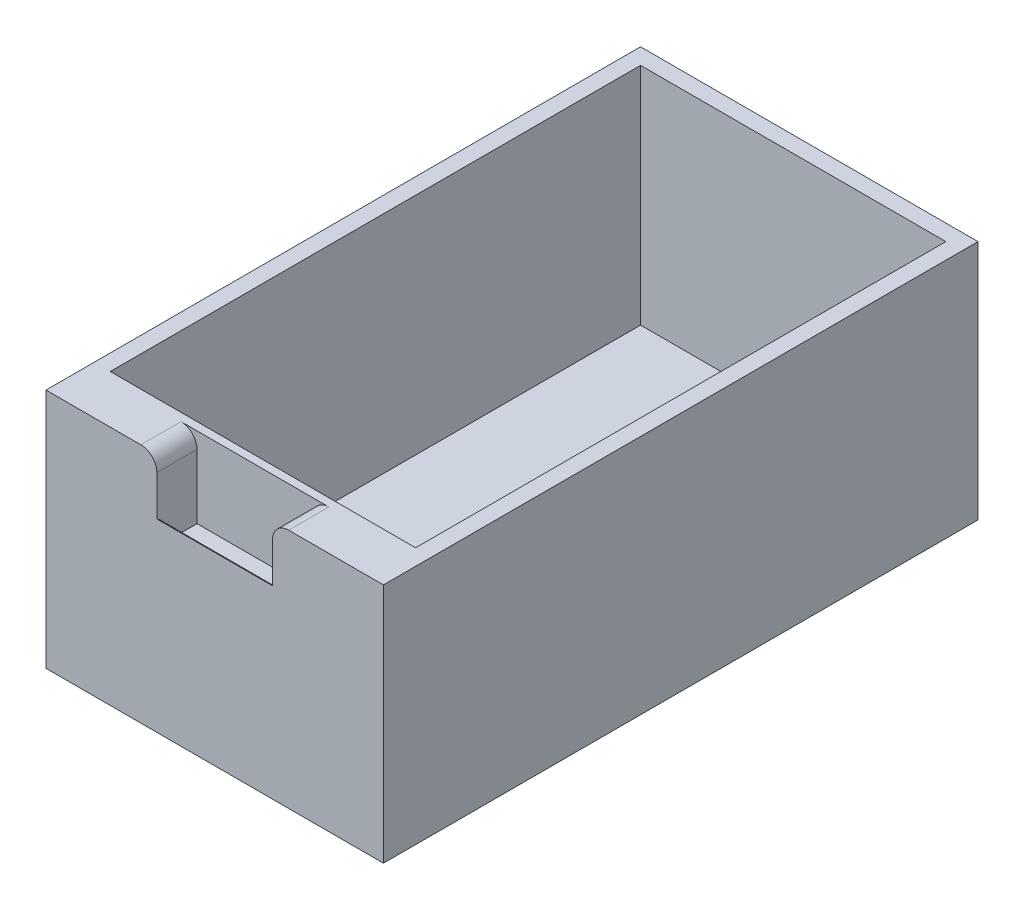
ISO-10303-21;
HEADER;
FILE_DESCRIPTION(('STEP AP214'),'2;1');
FILE_NAME('part.step','',(''),(''),'','','');
FILE_SCHEMA(('AUTOMOTIVE_DESIGN { 1 0 10303 214 1 1 1 1 }'));
ENDSEC;
DATA;
#1=APPLICATION_CONTEXT('core data for automotive mechanical design processes');
#2=APPLICATION_PROTOCOL_DEFINITION('international standard','automotive_design',2000,#1);
#3=PRODUCT_CONTEXT('',#1,'mechanical');
#4=PRODUCT('Part','Part','',(#3));
#5=PRODUCT_RELATED_PRODUCT_CATEGORY('part','',(#4));
#6=PRODUCT_DEFINITION_FORMATION('','',#4);
#7=PRODUCT_DEFINITION_CONTEXT('part definition',#1,'design');
#8=PRODUCT_DEFINITION('design','',#6,#7);
#9=PRODUCT_DEFINITION_SHAPE('','',#8);
#10=(LENGTH_UNIT() NAMED_UNIT(*) SI_UNIT(.MILLI.,.METRE.));
#11=(NAMED_UNIT(*) PLANE_ANGLE_UNIT() SI_UNIT($,.RADIAN.));
#12=(NAMED_UNIT(*) SI_UNIT($,.STERADIAN.) SOLID_ANGLE_UNIT());
#13=UNCERTAINTY_MEASURE_WITH_UNIT(LENGTH_MEASURE(1.E-05),#10,'distance_accuracy_value','');
#14=(GEOMETRIC_REPRESENTATION_CONTEXT(3) GLOBAL_UNCERTAINTY_ASSIGNED_CONTEXT((#13)) GLOBAL_UNIT_ASSIGNED_CONTEXT((#10,
#11,#12)) REPRESENTATION_CONTEXT('',''));
#15=CARTESIAN_POINT('',(0.,0.,0.));
#16=DIRECTION('',(0.,0.,1.));
#17=DIRECTION('',(1.,0.,0.));
#18=AXIS2_PLACEMENT_3D('',#15,#16,#17);
#19=CARTESIAN_POINT('',(-159.477344992051,63.8235294117647,-370.));
#20=DIRECTION('',(-1.,0.,0.));
#21=DIRECTION('',(0.,0.,1.));
#22=AXIS2_PLACEMENT_3D('',#19,#20,#21);
#23=PLANE('',#22);
#24=DIRECTION('',(0.,-1.,0.));
#25=VECTOR('',#24,1.);
#26=CARTESIAN_POINT('',(-159.477344992051,63.8235294117647,0.));
#27=LINE('',#26,#25);
#28=CARTESIAN_POINT('',(-159.477344992051,63.8235294117647,0.));
#29=VERTEX_POINT('',#28);
#30=CARTESIAN_POINT('',(-159.477344992051,-86.1764705882353,0.));
#31=VERTEX_POINT('',#30);
#32=EDGE_CURVE('E212',#29,#31,#27,.T.);
#33=ORIENTED_EDGE('',*,*,#32,.F.);
#34=DIRECTION('',(0.,0.,1.));
#35=VECTOR('',#34,1.);
#36=CARTESIAN_POINT('',(-159.477344992051,63.8235294117647,-370.));
#37=LINE('',#36,#35);
#38=CARTESIAN_POINT('',(-159.477344992051,63.8235294117647,-370.));
#39=VERTEX_POINT('',#38);
#40=EDGE_CURVE('E244',#39,#29,#37,.T.);
#41=ORIENTED_EDGE('',*,*,#40,.F.);
#42=DIRECTION('',(0.,-1.,0.));
#43=VECTOR('',#42,1.);
#44=CARTESIAN_POINT('',(-159.477344992051,63.8235294117647,-370.));
#45=LINE('',#44,#43);
#46=CARTESIAN_POINT('',(-159.477344992051,-86.1764705882353,-370.));
#47=VERTEX_POINT('',#46);
#48=EDGE_CURVE('E219',#39,#47,#45,.T.);
#49=ORIENTED_EDGE('',*,*,#48,.T.);
#50=DIRECTION('',(0.,0.,1.));
#51=VECTOR('',#50,1.);
#52=CARTESIAN_POINT('',(-159.477344992051,-86.1764705882353,-370.));
#53=LINE('',#52,#51);
#54=EDGE_CURVE('E232',#47,#31,#53,.T.);
#55=ORIENTED_EDGE('',*,*,#54,.T.);
#56=EDGE_LOOP('',(#33,#41,#49,#55));
#57=FACE_BOUND('',#56,.T.);
#58=ADVANCED_FACE('F35',(#57),#23,.T.);
#59=CARTESIAN_POINT('',(-159.477344992051,63.8235294117647,-370.));
#60=DIRECTION('',(0.,1.,0.));
#61=DIRECTION('',(0.,0.,1.));
#62=AXIS2_PLACEMENT_3D('',#59,#60,#61);
#63=PLANE('',#62);
#64=DIRECTION('',(-1.,0.,0.));
#65=VECTOR('',#64,1.);
#66=CARTESIAN_POINT('',(-90.4773449920508,63.8235294117647,-25.));
#67=LINE('',#66,#65);
#68=CARTESIAN_POINT('',(-8.47734499205077,63.8235294117647,-25.));
#69=VERTEX_POINT('',#68);
#70=CARTESIAN_POINT('',(-100.477344992051,63.8235294117647,-25.));
#71=VERTEX_POINT('',#70);
#72=EDGE_CURVE('E170',#69,#71,#67,.T.);
#73=ORIENTED_EDGE('',*,*,#72,.F.);
#74=DIRECTION('',(0.,0.,-1.));
#75=VECTOR('',#74,1.);
#76=CARTESIAN_POINT('',(-8.47734499205077,63.8235294117647,0.));
#77=LINE('',#76,#75);
#78=CARTESIAN_POINT('',(-8.47734499205077,63.8235294117647,0.));
#79=VERTEX_POINT('',#78);
#80=EDGE_CURVE('E265',#69,#79,#77,.F.);
#81=ORIENTED_EDGE('',*,*,#80,.T.);
#82=DIRECTION('',(-1.,0.,0.));
#83=VECTOR('',#82,1.);
#84=CARTESIAN_POINT('',(-159.477344992051,63.8235294117647,0.));
#85=LINE('',#84,#83);
#86=CARTESIAN_POINT('',(50.5226550079492,63.8235294117647,0.));
#87=VERTEX_POINT('',#86);
#88=EDGE_CURVE('E223',#87,#79,#85,.T.);
#89=ORIENTED_EDGE('',*,*,#88,.F.);
#90=DIRECTION('',(0.,0.,1.));
#91=VECTOR('',#90,1.);
#92=CARTESIAN_POINT('',(50.5226550079492,63.8235294117647,-370.));
#93=LINE('',#92,#91);
#94=CARTESIAN_POINT('',(50.5226550079492,63.8235294117647,-370.));
#95=VERTEX_POINT('',#94);
#96=EDGE_CURVE('E248',#95,#87,#93,.T.);
#97=ORIENTED_EDGE('',*,*,#96,.F.);
#98=DIRECTION('',(-1.,0.,0.));
#99=VECTOR('',#98,1.);
#100=CARTESIAN_POINT('',(-159.477344992051,63.8235294117647,-370.));
#101=LINE('',#100,#99);
#102=EDGE_CURVE('E229',#95,#39,#101,.T.);
#103=ORIENTED_EDGE('',*,*,#102,.T.);
#104=ORIENTED_EDGE('',*,*,#40,.T.);
#105=CARTESIAN_POINT('',(-100.477344992051,63.8235294117647,0.));
#106=VERTEX_POINT('',#105);
#107=EDGE_CURVE('E241',#106,#29,#85,.T.);
#108=ORIENTED_EDGE('',*,*,#107,.F.);
#109=DIRECTION('',(0.,0.,1.));
#110=VECTOR('',#109,1.);
#111=CARTESIAN_POINT('',(-100.477344992051,63.8235294117647,-25.));
#112=LINE('',#111,#110);
#113=EDGE_CURVE('E257',#106,#71,#112,.F.);
#114=ORIENTED_EDGE('',*,*,#113,.T.);
#115=EDGE_LOOP('',(#73,#81,#89,#97,#103,#104,#108,#114));
#116=FACE_BOUND('',#115,.T.);
#117=DIRECTION('',(0.,0.,1.));
#118=VECTOR('',#117,1.);
#119=CARTESIAN_POINT('',(-149.477344992051,63.8235294117647,-360.));
#120=LINE('',#119,#118);
#121=CARTESIAN_POINT('',(-149.477344992051,63.8235294117647,-360.));
#122=VERTEX_POINT('',#121);
#123=CARTESIAN_POINT('',(-149.477344992051,63.8235294117647,-30.));
#124=VERTEX_POINT('',#123);
#125=EDGE_CURVE('E178',#122,#124,#120,.T.);
#126=ORIENTED_EDGE('',*,*,#125,.F.);
#127=DIRECTION('',(-1.,0.,0.));
#128=VECTOR('',#127,1.);
#129=CARTESIAN_POINT('',(-149.477344992051,63.8235294117647,-360.));
#130=LINE('',#129,#128);
#131=CARTESIAN_POINT('',(40.5226550079492,63.8235294117647,-360.));
#132=VERTEX_POINT('',#131);
#133=EDGE_CURVE('E191',#132,#122,#130,.T.);
#134=ORIENTED_EDGE('',*,*,#133,.F.);
#135=DIRECTION('',(0.,0.,-1.));
#136=VECTOR('',#135,1.);
#137=CARTESIAN_POINT('',(40.5226550079492,63.8235294117647,-360.));
#138=LINE('',#137,#136);
#139=CARTESIAN_POINT('',(40.5226550079492,63.8235294117647,-30.));
#140=VERTEX_POINT('',#139);
#141=EDGE_CURVE('E205',#140,#132,#138,.T.);
#142=ORIENTED_EDGE('',*,*,#141,.F.);
#143=DIRECTION('',(1.,0.,0.));
#144=VECTOR('',#143,1.);
#145=CARTESIAN_POINT('',(-149.477344992051,63.8235294117647,-30.));
#146=LINE('',#145,#144);
#147=EDGE_CURVE('E202',#124,#140,#146,.T.);
#148=ORIENTED_EDGE('',*,*,#147,.F.);
#149=EDGE_LOOP('',(#126,#134,#142,#148));
#150=FACE_BOUND('',#149,.T.);
#151=ADVANCED_FACE('F289',(#116,#150),#63,.T.);
#152=CARTESIAN_POINT('',(50.5226550079492,63.8235294117647,-370.));
#153=DIRECTION('',(1.,0.,0.));
#154=DIRECTION('',(0.,1.,0.));
#155=AXIS2_PLACEMENT_3D('',#152,#153,#154);
#156=PLANE('',#155);
#157=DIRECTION('',(0.,1.,0.));
#158=VECTOR('',#157,1.);
#159=CARTESIAN_POINT('',(50.5226550079492,63.8235294117647,0.));
#160=LINE('',#159,#158);
#161=CARTESIAN_POINT('',(50.5226550079493,-86.1764705882353,0.));
#162=VERTEX_POINT('',#161);
#163=EDGE_CURVE('E238',#162,#87,#160,.T.);
#164=ORIENTED_EDGE('',*,*,#163,.F.);
#165=DIRECTION('',(0.,0.,1.));
#166=VECTOR('',#165,1.);
#167=CARTESIAN_POINT('',(50.5226550079493,-86.1764705882353,-370.));
#168=LINE('',#167,#166);
#169=CARTESIAN_POINT('',(50.5226550079493,-86.1764705882353,-370.));
#170=VERTEX_POINT('',#169);
#171=EDGE_CURVE('E250',#170,#162,#168,.T.);
#172=ORIENTED_EDGE('',*,*,#171,.F.);
#173=DIRECTION('',(0.,1.,0.));
#174=VECTOR('',#173,1.);
#175=CARTESIAN_POINT('',(50.5226550079492,63.8235294117647,-370.));
#176=LINE('',#175,#174);
#177=EDGE_CURVE('E226',#170,#95,#176,.T.);
#178=ORIENTED_EDGE('',*,*,#177,.T.);
#179=ORIENTED_EDGE('',*,*,#96,.T.);
#180=EDGE_LOOP('',(#164,#172,#178,#179));
#181=FACE_BOUND('',#180,.T.);
#182=ADVANCED_FACE('F295',(#181),#156,.T.);
#183=CARTESIAN_POINT('',(-159.477344992051,-86.1764705882353,-370.));
#184=DIRECTION('',(0.,-1.,0.));
#185=DIRECTION('',(1.,0.,0.));
#186=AXIS2_PLACEMENT_3D('',#183,#184,#185);
#187=PLANE('',#186);
#188=DIRECTION('',(1.,0.,0.));
#189=VECTOR('',#188,1.);
#190=CARTESIAN_POINT('',(-159.477344992051,-86.1764705882353,0.));
#191=LINE('',#190,#189);
#192=EDGE_CURVE('E235',#31,#162,#191,.T.);
#193=ORIENTED_EDGE('',*,*,#192,.F.);
#194=ORIENTED_EDGE('',*,*,#54,.F.);
#195=DIRECTION('',(1.,0.,0.));
#196=VECTOR('',#195,1.);
#197=CARTESIAN_POINT('',(-159.477344992051,-86.1764705882353,-370.));
#198=LINE('',#197,#196);
#199=EDGE_CURVE('E222',#47,#170,#198,.T.);
#200=ORIENTED_EDGE('',*,*,#199,.T.);
#201=ORIENTED_EDGE('',*,*,#171,.T.);
#202=EDGE_LOOP('',(#193,#194,#200,#201));
#203=FACE_BOUND('',#202,.T.);
#204=ADVANCED_FACE('F301',(#203),#187,.T.);
#205=CARTESIAN_POINT('',(0.,0.,-370.));
#206=DIRECTION('',(0.,0.,1.));
#207=DIRECTION('',(1.,0.,0.));
#208=AXIS2_PLACEMENT_3D('',#205,#206,#207);
#209=PLANE('',#208);
#210=ORIENTED_EDGE('',*,*,#48,.F.);
#211=ORIENTED_EDGE('',*,*,#102,.F.);
#212=ORIENTED_EDGE('',*,*,#177,.F.);
#213=ORIENTED_EDGE('',*,*,#199,.F.);
#214=EDGE_LOOP('',(#210,#211,#212,#213));
#215=FACE_BOUND('',#214,.T.);
#216=ADVANCED_FACE('F327',(#215),#209,.F.);
#217=CARTESIAN_POINT('',(0.,0.,0.));
#218=DIRECTION('',(0.,0.,1.));
#219=DIRECTION('',(1.,0.,0.));
#220=AXIS2_PLACEMENT_3D('',#217,#218,#219);
#221=PLANE('',#220);
#222=ORIENTED_EDGE('',*,*,#88,.T.);
#223=CARTESIAN_POINT('',(-8.47734499205077,53.8235294117647,0.));
#224=DIRECTION('',(0.,0.,1.));
#225=DIRECTION('',(1.,0.,0.));
#226=AXIS2_PLACEMENT_3D('',#223,#224,#225);
#227=CIRCLE('',#226,10.);
#228=CARTESIAN_POINT('',(-18.4773449920508,53.8235294117647,0.));
#229=VERTEX_POINT('',#228);
#230=EDGE_CURVE('E267',#79,#229,#227,.T.);
#231=ORIENTED_EDGE('',*,*,#230,.T.);
#232=DIRECTION('',(0.,1.,0.));
#233=VECTOR('',#232,1.);
#234=CARTESIAN_POINT('',(-18.4773449920508,28.8235294117647,0.));
#235=LINE('',#234,#233);
#236=CARTESIAN_POINT('',(-18.4773449920508,28.8235294117647,0.));
#237=VERTEX_POINT('',#236);
#238=EDGE_CURVE('E182',#237,#229,#235,.T.);
#239=ORIENTED_EDGE('',*,*,#238,.F.);
#240=DIRECTION('',(1.,0.,0.));
#241=VECTOR('',#240,1.);
#242=CARTESIAN_POINT('',(-90.4773449920508,28.8235294117647,0.));
#243=LINE('',#242,#241);
#244=CARTESIAN_POINT('',(-90.4773449920508,28.8235294117647,0.));
#245=VERTEX_POINT('',#244);
#246=EDGE_CURVE('E172',#245,#237,#243,.T.);
#247=ORIENTED_EDGE('',*,*,#246,.F.);
#248=DIRECTION('',(0.,1.,0.));
#249=VECTOR('',#248,1.);
#250=CARTESIAN_POINT('',(-90.4773449920508,28.8235294117647,0.));
#251=LINE('',#250,#249);
#252=CARTESIAN_POINT('',(-90.4773449920508,53.8235294117647,0.));
#253=VERTEX_POINT('',#252);
#254=EDGE_CURVE('E174',#245,#253,#251,.T.);
#255=ORIENTED_EDGE('',*,*,#254,.T.);
#256=CARTESIAN_POINT('',(-100.477344992051,53.8235294117647,0.));
#257=DIRECTION('',(0.,0.,1.));
#258=DIRECTION('',(1.,0.,0.));
#259=AXIS2_PLACEMENT_3D('',#256,#257,#258);
#260=CIRCLE('',#259,10.);
#261=EDGE_CURVE('E255',#253,#106,#260,.T.);
#262=ORIENTED_EDGE('',*,*,#261,.T.);
#263=ORIENTED_EDGE('',*,*,#107,.T.);
#264=ORIENTED_EDGE('',*,*,#32,.T.);
#265=ORIENTED_EDGE('',*,*,#192,.T.);
#266=ORIENTED_EDGE('',*,*,#163,.T.);
#267=EDGE_LOOP('',(#222,#231,#239,#247,#255,#262,#263,#264,#265,#266));
#268=FACE_BOUND('',#267,.T.);
#269=ADVANCED_FACE('F279',(#268),#221,.T.);
#270=CARTESIAN_POINT('',(-149.477344992051,-76.1764705882353,-360.));
#271=DIRECTION('',(-1.,0.,0.));
#272=DIRECTION('',(0.,0.,1.));
#273=AXIS2_PLACEMENT_3D('',#270,#271,#272);
#274=PLANE('',#273);
#275=ORIENTED_EDGE('',*,*,#125,.T.);
#276=DIRECTION('',(0.,1.,0.));
#277=VECTOR('',#276,1.);
#278=CARTESIAN_POINT('',(-149.477344992051,-76.1764705882353,-30.));
#279=LINE('',#278,#277);
#280=CARTESIAN_POINT('',(-149.477344992051,-76.1764705882353,-30.));
#281=VERTEX_POINT('',#280);
#282=EDGE_CURVE('E200',#281,#124,#279,.T.);
#283=ORIENTED_EDGE('',*,*,#282,.F.);
#284=DIRECTION('',(0.,0.,1.));
#285=VECTOR('',#284,1.);
#286=CARTESIAN_POINT('',(-149.477344992051,-76.1764705882353,-360.));
#287=LINE('',#286,#285);
#288=CARTESIAN_POINT('',(-149.477344992051,-76.1764705882353,-360.));
#289=VERTEX_POINT('',#288);
#290=EDGE_CURVE('E187',#289,#281,#287,.T.);
#291=ORIENTED_EDGE('',*,*,#290,.F.);
#292=DIRECTION('',(0.,1.,0.));
#293=VECTOR('',#292,1.);
#294=CARTESIAN_POINT('',(-149.477344992051,-76.1764705882353,-360.));
#295=LINE('',#294,#293);
#296=EDGE_CURVE('E210',#289,#122,#295,.T.);
#297=ORIENTED_EDGE('',*,*,#296,.T.);
#298=EDGE_LOOP('',(#275,#283,#291,#297));
#299=FACE_BOUND('',#298,.T.);
#300=ADVANCED_FACE('F334',(#299),#274,.F.);
#301=CARTESIAN_POINT('',(-149.477344992051,-76.1764705882353,-360.));
#302=DIRECTION('',(0.,0.,-1.));
#303=DIRECTION('',(-1.,0.,0.));
#304=AXIS2_PLACEMENT_3D('',#301,#302,#303);
#305=PLANE('',#304);
#306=ORIENTED_EDGE('',*,*,#133,.T.);
#307=ORIENTED_EDGE('',*,*,#296,.F.);
#308=DIRECTION('',(-1.,0.,0.));
#309=VECTOR('',#308,1.);
#310=CARTESIAN_POINT('',(-149.477344992051,-76.1764705882353,-360.));
#311=LINE('',#310,#309);
#312=CARTESIAN_POINT('',(40.5226550079492,-76.1764705882353,-360.));
#313=VERTEX_POINT('',#312);
#314=EDGE_CURVE('E197',#313,#289,#311,.T.);
#315=ORIENTED_EDGE('',*,*,#314,.F.);
#316=DIRECTION('',(0.,1.,0.));
#317=VECTOR('',#316,1.);
#318=CARTESIAN_POINT('',(40.5226550079492,-76.1764705882353,-360.));
#319=LINE('',#318,#317);
#320=EDGE_CURVE('E213',#313,#132,#319,.T.);
#321=ORIENTED_EDGE('',*,*,#320,.T.);
#322=EDGE_LOOP('',(#306,#307,#315,#321));
#323=FACE_BOUND('',#322,.T.);
#324=ADVANCED_FACE('F361',(#323),#305,.F.);
#325=CARTESIAN_POINT('',(40.5226550079492,-76.1764705882353,-360.));
#326=DIRECTION('',(1.,0.,0.));
#327=DIRECTION('',(0.,0.,-1.));
#328=AXIS2_PLACEMENT_3D('',#325,#326,#327);
#329=PLANE('',#328);
#330=ORIENTED_EDGE('',*,*,#141,.T.);
#331=ORIENTED_EDGE('',*,*,#320,.F.);
#332=DIRECTION('',(0.,0.,-1.));
#333=VECTOR('',#332,1.);
#334=CARTESIAN_POINT('',(40.5226550079492,-76.1764705882353,-360.));
#335=LINE('',#334,#333);
#336=CARTESIAN_POINT('',(40.5226550079492,-76.1764705882353,-30.));
#337=VERTEX_POINT('',#336);
#338=EDGE_CURVE('E194',#337,#313,#335,.T.);
#339=ORIENTED_EDGE('',*,*,#338,.F.);
#340=DIRECTION('',(0.,1.,0.));
#341=VECTOR('',#340,1.);
#342=CARTESIAN_POINT('',(40.5226550079492,-76.1764705882353,-30.));
#343=LINE('',#342,#341);
#344=EDGE_CURVE('E215',#337,#140,#343,.T.);
#345=ORIENTED_EDGE('',*,*,#344,.T.);
#346=EDGE_LOOP('',(#330,#331,#339,#345));
#347=FACE_BOUND('',#346,.T.);
#348=ADVANCED_FACE('F370',(#347),#329,.F.);
#349=CARTESIAN_POINT('',(-149.477344992051,-76.1764705882353,-30.));
#350=DIRECTION('',(0.,0.,1.));
#351=DIRECTION('',(1.,0.,0.));
#352=AXIS2_PLACEMENT_3D('',#349,#350,#351);
#353=PLANE('',#352);
#354=ORIENTED_EDGE('',*,*,#147,.T.);
#355=ORIENTED_EDGE('',*,*,#344,.F.);
#356=DIRECTION('',(1.,0.,0.));
#357=VECTOR('',#356,1.);
#358=CARTESIAN_POINT('',(-149.477344992051,-76.1764705882353,-30.));
#359=LINE('',#358,#357);
#360=EDGE_CURVE('E190',#281,#337,#359,.T.);
#361=ORIENTED_EDGE('',*,*,#360,.F.);
#362=ORIENTED_EDGE('',*,*,#282,.T.);
#363=EDGE_LOOP('',(#354,#355,#361,#362));
#364=FACE_BOUND('',#363,.T.);
#365=ADVANCED_FACE('F380',(#364),#353,.F.);
#366=CARTESIAN_POINT('',(0.,-76.1764705882353,0.));
#367=DIRECTION('',(0.,1.,0.));
#368=DIRECTION('',(0.,0.,1.));
#369=AXIS2_PLACEMENT_3D('',#366,#367,#368);
#370=PLANE('',#369);
#371=ORIENTED_EDGE('',*,*,#290,.T.);
#372=ORIENTED_EDGE('',*,*,#360,.T.);
#373=ORIENTED_EDGE('',*,*,#338,.T.);
#374=ORIENTED_EDGE('',*,*,#314,.T.);
#375=EDGE_LOOP('',(#371,#372,#373,#374));
#376=FACE_BOUND('',#375,.T.);
#377=ADVANCED_FACE('F390',(#376),#370,.T.);
#378=CARTESIAN_POINT('',(-90.4773449920508,28.8235294117647,0.));
#379=DIRECTION('',(-1.,0.,0.));
#380=DIRECTION('',(0.,0.,1.));
#381=AXIS2_PLACEMENT_3D('',#378,#379,#380);
#382=PLANE('',#381);
#383=DIRECTION('',(0.,1.,0.));
#384=VECTOR('',#383,1.);
#385=CARTESIAN_POINT('',(-90.4773449920508,28.8235294117647,-25.));
#386=LINE('',#385,#384);
#387=CARTESIAN_POINT('',(-90.4773449920508,13.8235294117647,-25.));
#388=VERTEX_POINT('',#387);
#389=CARTESIAN_POINT('',(-90.4773449920508,53.8235294117647,-25.));
#390=VERTEX_POINT('',#389);
#391=EDGE_CURVE('E176',#388,#390,#386,.T.);
#392=ORIENTED_EDGE('',*,*,#391,.T.);
#393=DIRECTION('',(0.,0.,1.));
#394=VECTOR('',#393,1.);
#395=CARTESIAN_POINT('',(-90.4773449920508,53.8235294117647,0.));
#396=LINE('',#395,#394);
#397=EDGE_CURVE('E247',#390,#253,#396,.T.);
#398=ORIENTED_EDGE('',*,*,#397,.T.);
#399=ORIENTED_EDGE('',*,*,#254,.F.);
#400=CARTESIAN_POINT('',(-90.4773449920508,20.1632753739203,5.));
#401=DIRECTION('',(-1.,0.,0.));
#402=DIRECTION('',(0.,0.,1.));
#403=AXIS2_PLACEMENT_3D('',#400,#401,#402);
#404=CIRCLE('',#403,10.);
#405=CARTESIAN_POINT('',(-90.4773449920508,20.1632753739203,-5.));
#406=VERTEX_POINT('',#405);
#407=EDGE_CURVE('E11',#245,#406,#404,.T.);
#408=ORIENTED_EDGE('',*,*,#407,.T.);
#409=DIRECTION('',(0.,1.,0.));
#410=VECTOR('',#409,1.);
#411=CARTESIAN_POINT('',(-90.4773449920508,13.8235294117647,-5.));
#412=LINE('',#411,#410);
#413=CARTESIAN_POINT('',(-90.4773449920508,13.8235294117647,-5.));
#414=VERTEX_POINT('',#413);
#415=EDGE_CURVE('E144',#414,#406,#412,.T.);
#416=ORIENTED_EDGE('',*,*,#415,.F.);
#417=DIRECTION('',(0.,0.,1.));
#418=VECTOR('',#417,1.);
#419=CARTESIAN_POINT('',(-90.4773449920508,13.8235294117647,-25.));
#420=LINE('',#419,#418);
#421=EDGE_CURVE('E149',#388,#414,#420,.T.);
#422=ORIENTED_EDGE('',*,*,#421,.F.);
#423=EDGE_LOOP('',(#392,#398,#399,#408,#416,#422));
#424=FACE_BOUND('',#423,.T.);
#425=ADVANCED_FACE('F147',(#424),#382,.F.);
#426=CARTESIAN_POINT('',(-90.4773449920508,28.8235294117647,-25.));
#427=DIRECTION('',(0.,0.,-1.));
#428=DIRECTION('',(-1.,0.,0.));
#429=AXIS2_PLACEMENT_3D('',#426,#427,#428);
#430=PLANE('',#429);
#431=ORIENTED_EDGE('',*,*,#72,.T.);
#432=CARTESIAN_POINT('',(-100.477344992051,53.8235294117647,-25.));
#433=DIRECTION('',(0.,0.,-1.));
#434=DIRECTION('',(-1.,0.,0.));
#435=AXIS2_PLACEMENT_3D('',#432,#433,#434);
#436=CIRCLE('',#435,10.);
#437=EDGE_CURVE('E260',#71,#390,#436,.T.);
#438=ORIENTED_EDGE('',*,*,#437,.T.);
#439=ORIENTED_EDGE('',*,*,#391,.F.);
#440=DIRECTION('',(-1.,0.,0.));
#441=VECTOR('',#440,1.);
#442=CARTESIAN_POINT('',(-90.4773449920508,13.8235294117647,-25.));
#443=LINE('',#442,#441);
#444=CARTESIAN_POINT('',(-18.4773449920508,13.8235294117647,-25.));
#445=VERTEX_POINT('',#444);
#446=EDGE_CURVE('E153',#445,#388,#443,.T.);
#447=ORIENTED_EDGE('',*,*,#446,.F.);
#448=DIRECTION('',(0.,1.,0.));
#449=VECTOR('',#448,1.);
#450=CARTESIAN_POINT('',(-18.4773449920508,28.8235294117647,-25.));
#451=LINE('',#450,#449);
#452=CARTESIAN_POINT('',(-18.4773449920508,53.8235294117647,-25.));
#453=VERTEX_POINT('',#452);
#454=EDGE_CURVE('E179',#445,#453,#451,.T.);
#455=ORIENTED_EDGE('',*,*,#454,.T.);
#456=CARTESIAN_POINT('',(-8.47734499205077,53.8235294117647,-25.));
#457=DIRECTION('',(0.,0.,-1.));
#458=DIRECTION('',(-1.,0.,0.));
#459=AXIS2_PLACEMENT_3D('',#456,#457,#458);
#460=CIRCLE('',#459,10.);
#461=EDGE_CURVE('E269',#453,#69,#460,.T.);
#462=ORIENTED_EDGE('',*,*,#461,.T.);
#463=EDGE_LOOP('',(#431,#438,#439,#447,#455,#462));
#464=FACE_BOUND('',#463,.T.);
#465=ADVANCED_FACE('F313',(#464),#430,.F.);
#466=CARTESIAN_POINT('',(-18.4773449920508,28.8235294117647,0.));
#467=DIRECTION('',(1.,0.,0.));
#468=DIRECTION('',(0.,0.,-1.));
#469=AXIS2_PLACEMENT_3D('',#466,#467,#468);
#470=PLANE('',#469);
#471=ORIENTED_EDGE('',*,*,#238,.T.);
#472=DIRECTION('',(0.,0.,-1.));
#473=VECTOR('',#472,1.);
#474=CARTESIAN_POINT('',(-18.4773449920508,53.8235294117647,-25.));
#475=LINE('',#474,#473);
#476=EDGE_CURVE('E262',#229,#453,#475,.T.);
#477=ORIENTED_EDGE('',*,*,#476,.T.);
#478=ORIENTED_EDGE('',*,*,#454,.F.);
#479=DIRECTION('',(0.,0.,-1.));
#480=VECTOR('',#479,1.);
#481=CARTESIAN_POINT('',(-18.4773449920508,13.8235294117647,-25.));
#482=LINE('',#481,#480);
#483=CARTESIAN_POINT('',(-18.4773449920508,13.8235294117647,-5.));
#484=VERTEX_POINT('',#483);
#485=EDGE_CURVE('E162',#484,#445,#482,.T.);
#486=ORIENTED_EDGE('',*,*,#485,.F.);
#487=DIRECTION('',(0.,1.,0.));
#488=VECTOR('',#487,1.);
#489=CARTESIAN_POINT('',(-18.4773449920508,13.8235294117647,-5.));
#490=LINE('',#489,#488);
#491=CARTESIAN_POINT('',(-18.4773449920508,20.1632753739203,-5.));
#492=VERTEX_POINT('',#491);
#493=EDGE_CURVE('E152',#484,#492,#490,.T.);
#494=ORIENTED_EDGE('',*,*,#493,.T.);
#495=CARTESIAN_POINT('',(-18.4773449920508,20.1632753739203,5.));
#496=DIRECTION('',(1.,0.,0.));
#497=DIRECTION('',(0.,0.,-1.));
#498=AXIS2_PLACEMENT_3D('',#495,#496,#497);
#499=CIRCLE('',#498,10.);
#500=EDGE_CURVE('E43',#492,#237,#499,.T.);
#501=ORIENTED_EDGE('',*,*,#500,.T.);
#502=EDGE_LOOP('',(#471,#477,#478,#486,#494,#501));
#503=FACE_BOUND('',#502,.T.);
#504=ADVANCED_FACE('F275',(#503),#470,.F.);
#505=CARTESIAN_POINT('',(-90.4773449920508,13.8235294117647,-5.));
#506=DIRECTION('',(0.,0.,1.));
#507=DIRECTION('',(1.,0.,0.));
#508=AXIS2_PLACEMENT_3D('',#505,#506,#507);
#509=PLANE('',#508);
#510=ORIENTED_EDGE('',*,*,#415,.T.);
#511=DIRECTION('',(-1.,0.,0.));
#512=VECTOR('',#511,1.);
#513=CARTESIAN_POINT('',(-90.4773449920508,20.1632753739203,-5.));
#514=LINE('',#513,#512);
#515=EDGE_CURVE('E272',#406,#492,#514,.F.);
#516=ORIENTED_EDGE('',*,*,#515,.T.);
#517=ORIENTED_EDGE('',*,*,#493,.F.);
#518=DIRECTION('',(1.,0.,0.));
#519=VECTOR('',#518,1.);
#520=CARTESIAN_POINT('',(-90.4773449920508,13.8235294117647,-5.));
#521=LINE('',#520,#519);
#522=EDGE_CURVE('E156',#414,#484,#521,.T.);
#523=ORIENTED_EDGE('',*,*,#522,.F.);
#524=EDGE_LOOP('',(#510,#516,#517,#523));
#525=FACE_BOUND('',#524,.T.);
#526=ADVANCED_FACE('F157',(#525),#509,.F.);
#527=CARTESIAN_POINT('',(0.,13.8235294117647,0.));
#528=DIRECTION('',(0.,1.,0.));
#529=DIRECTION('',(0.,0.,1.));
#530=AXIS2_PLACEMENT_3D('',#527,#528,#529);
#531=PLANE('',#530);
#532=ORIENTED_EDGE('',*,*,#421,.T.);
#533=ORIENTED_EDGE('',*,*,#522,.T.);
#534=ORIENTED_EDGE('',*,*,#485,.T.);
#535=ORIENTED_EDGE('',*,*,#446,.T.);
#536=EDGE_LOOP('',(#532,#533,#534,#535));
#537=FACE_BOUND('',#536,.T.);
#538=ADVANCED_FACE('F164',(#537),#531,.T.);
#539=CARTESIAN_POINT('',(-100.477344992051,53.8235294117647,0.));
#540=DIRECTION('',(0.,0.,-1.));
#541=DIRECTION('',(-1.,0.,0.));
#542=AXIS2_PLACEMENT_3D('',#539,#540,#541);
#543=CYLINDRICAL_SURFACE('',#542,10.);
#544=ORIENTED_EDGE('',*,*,#437,.F.);
#545=ORIENTED_EDGE('',*,*,#113,.F.);
#546=ORIENTED_EDGE('',*,*,#261,.F.);
#547=ORIENTED_EDGE('',*,*,#397,.F.);
#548=EDGE_LOOP('',(#544,#545,#546,#547));
#549=FACE_BOUND('',#548,.T.);
#550=ADVANCED_FACE('F286',(#549),#543,.T.);
#551=CARTESIAN_POINT('',(-8.47734499205077,53.8235294117647,0.));
#552=DIRECTION('',(0.,0.,1.));
#553=DIRECTION('',(1.,0.,0.));
#554=AXIS2_PLACEMENT_3D('',#551,#552,#553);
#555=CYLINDRICAL_SURFACE('',#554,10.);
#556=ORIENTED_EDGE('',*,*,#230,.F.);
#557=ORIENTED_EDGE('',*,*,#80,.F.);
#558=ORIENTED_EDGE('',*,*,#461,.F.);
#559=ORIENTED_EDGE('',*,*,#476,.F.);
#560=EDGE_LOOP('',(#556,#557,#558,#559));
#561=FACE_BOUND('',#560,.T.);
#562=ADVANCED_FACE('F282',(#561),#555,.T.);
#563=CARTESIAN_POINT('',(0.,20.1632753739203,5.));
#564=DIRECTION('',(-1.,0.,0.));
#565=DIRECTION('',(0.,0.,1.));
#566=AXIS2_PLACEMENT_3D('',#563,#564,#565);
#567=CYLINDRICAL_SURFACE('',#566,10.);
#568=ORIENTED_EDGE('',*,*,#407,.F.);
#569=ORIENTED_EDGE('',*,*,#246,.T.);
#570=ORIENTED_EDGE('',*,*,#500,.F.);
#571=ORIENTED_EDGE('',*,*,#515,.F.);
#572=EDGE_LOOP('',(#568,#569,#570,#571));
#573=FACE_BOUND('',#572,.T.);
#574=ADVANCED_FACE('F37',(#573),#567,.T.);
#575=CLOSED_SHELL('',(#58,#151,#182,#204,#216,#269,#300,#324,#348,#365,#377,#425,#465,#504,#526,
#538,#550,#562,#574));
#576=MANIFOLD_SOLID_BREP('B2',#575);
#577=ADVANCED_BREP_SHAPE_REPRESENTATION('',(#18,#576),#14);
#578=SHAPE_DEFINITION_REPRESENTATION(#9,#577);
ENDSEC;
END-ISO-10303-21;
